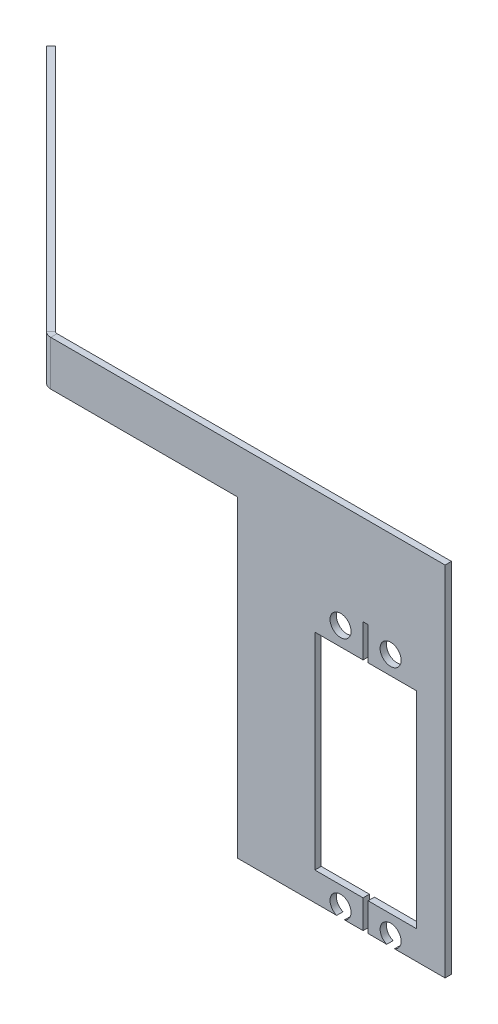
ISO-10303-21;
HEADER;
FILE_DESCRIPTION(('STEP AP214'),'2;1');
FILE_NAME('part.step','',(''),(''),'','','');
FILE_SCHEMA(('AUTOMOTIVE_DESIGN { 1 0 10303 214 1 1 1 1 }'));
ENDSEC;
DATA;
#1=APPLICATION_CONTEXT('core data for automotive mechanical design processes');
#2=APPLICATION_PROTOCOL_DEFINITION('international standard','automotive_design',2000,#1);
#3=PRODUCT_CONTEXT('',#1,'mechanical');
#4=PRODUCT('Part','Part','',(#3));
#5=PRODUCT_RELATED_PRODUCT_CATEGORY('part','',(#4));
#6=PRODUCT_DEFINITION_FORMATION('','',#4);
#7=PRODUCT_DEFINITION_CONTEXT('part definition',#1,'design');
#8=PRODUCT_DEFINITION('design','',#6,#7);
#9=PRODUCT_DEFINITION_SHAPE('','',#8);
#10=(LENGTH_UNIT() NAMED_UNIT(*) SI_UNIT(.MILLI.,.METRE.));
#11=(NAMED_UNIT(*) PLANE_ANGLE_UNIT() SI_UNIT($,.RADIAN.));
#12=(NAMED_UNIT(*) SI_UNIT($,.STERADIAN.) SOLID_ANGLE_UNIT());
#13=UNCERTAINTY_MEASURE_WITH_UNIT(LENGTH_MEASURE(1.E-05),#10,'distance_accuracy_value','');
#14=(GEOMETRIC_REPRESENTATION_CONTEXT(3) GLOBAL_UNCERTAINTY_ASSIGNED_CONTEXT((#13)) GLOBAL_UNIT_ASSIGNED_CONTEXT((#10,
#11,#12)) REPRESENTATION_CONTEXT('',''));
#15=CARTESIAN_POINT('',(0.,0.,0.));
#16=DIRECTION('',(0.,0.,1.));
#17=DIRECTION('',(1.,0.,0.));
#18=AXIS2_PLACEMENT_3D('',#15,#16,#17);
#19=CARTESIAN_POINT('',(-56.8418463273573,9.52499999999998,1.27000000000001));
#20=DIRECTION('',(0.,-1.,0.));
#21=DIRECTION('',(1.,0.,0.));
#22=AXIS2_PLACEMENT_3D('',#19,#20,#21);
#23=PLANE('',#22);
#24=DIRECTION('',(0.,0.,1.));
#25=VECTOR('',#24,1.);
#26=CARTESIAN_POINT('',(2.12440027263546,9.52500000000005,-49.6101558881365));
#27=LINE('',#26,#25);
#28=CARTESIAN_POINT('',(2.12440027263527,9.52499999999998,0.));
#29=VERTEX_POINT('',#28);
#30=CARTESIAN_POINT('',(2.12440027263528,9.52499999999998,1.26999999999991));
#31=VERTEX_POINT('',#30);
#32=EDGE_CURVE('E402',#29,#31,#27,.T.);
#33=ORIENTED_EDGE('',*,*,#32,.F.);
#34=DIRECTION('',(1.,0.,0.));
#35=VECTOR('',#34,1.);
#36=CARTESIAN_POINT('',(-56.8418463273573,9.52499999999998,0.));
#37=LINE('',#36,#35);
#38=CARTESIAN_POINT('',(5.84999999999999,9.52499999999998,-1.11022302462516E-13));
#39=VERTEX_POINT('',#38);
#40=EDGE_CURVE('E354',#29,#39,#37,.T.);
#41=ORIENTED_EDGE('',*,*,#40,.T.);
#42=DIRECTION('',(0.,0.,-1.));
#43=VECTOR('',#42,1.);
#44=CARTESIAN_POINT('',(5.84999999999999,9.52499999999998,1.27000000000001));
#45=LINE('',#44,#43);
#46=CARTESIAN_POINT('',(5.84999999999999,9.52499999999998,1.26999999999991));
#47=VERTEX_POINT('',#46);
#48=EDGE_CURVE('E393',#47,#39,#45,.T.);
#49=ORIENTED_EDGE('',*,*,#48,.F.);
#50=DIRECTION('',(1.,0.,0.));
#51=VECTOR('',#50,1.);
#52=CARTESIAN_POINT('',(-56.8418463273573,9.52499999999998,1.27000000000001));
#53=LINE('',#52,#51);
#54=EDGE_CURVE('E359',#31,#47,#53,.T.);
#55=ORIENTED_EDGE('',*,*,#54,.F.);
#56=EDGE_LOOP('',(#33,#41,#49,#55));
#57=FACE_BOUND('',#56,.T.);
#58=ADVANCED_FACE('F43',(#57),#23,.T.);
#59=DIRECTION('',(0.,0.,1.));
#60=VECTOR('',#59,1.);
#61=CARTESIAN_POINT('',(12.1244003386353,9.52500000000005,-49.6101558881365));
#62=LINE('',#61,#60);
#63=CARTESIAN_POINT('',(12.1244003386351,9.52499999999998,0.));
#64=VERTEX_POINT('',#63);
#65=CARTESIAN_POINT('',(12.1244003386351,9.52499999999998,1.26999999999991));
#66=VERTEX_POINT('',#65);
#67=EDGE_CURVE('E398',#64,#66,#62,.T.);
#68=ORIENTED_EDGE('',*,*,#67,.F.);
#69=CARTESIAN_POINT('',(22.225,9.52499999999998,-1.11076679072422E-13));
#70=VERTEX_POINT('',#69);
#71=EDGE_CURVE('E355',#64,#70,#37,.T.);
#72=ORIENTED_EDGE('',*,*,#71,.T.);
#73=DIRECTION('',(0.,0.,1.));
#74=VECTOR('',#73,1.);
#75=CARTESIAN_POINT('',(22.225,9.52499999999998,1.26999999999989));
#76=LINE('',#75,#74);
#77=CARTESIAN_POINT('',(22.225,9.52499999999998,1.26999999999989));
#78=VERTEX_POINT('',#77);
#79=EDGE_CURVE('E353',#78,#70,#76,.F.);
#80=ORIENTED_EDGE('',*,*,#79,.F.);
#81=EDGE_CURVE('E349',#66,#78,#53,.T.);
#82=ORIENTED_EDGE('',*,*,#81,.F.);
#83=EDGE_LOOP('',(#68,#72,#80,#82));
#84=FACE_BOUND('',#83,.T.);
#85=ADVANCED_FACE('F446',(#84),#23,.T.);
#86=DIRECTION('',(0.,0.,1.));
#87=VECTOR('',#86,1.);
#88=CARTESIAN_POINT('',(10.5755997273647,9.52500000000005,-49.6101558881365));
#89=LINE('',#88,#87);
#90=CARTESIAN_POINT('',(10.5755997273649,9.52499999999998,1.26999999999991));
#91=VERTEX_POINT('',#90);
#92=CARTESIAN_POINT('',(10.5755997273647,9.52500000000005,-1.11022302462516E-13));
#93=VERTEX_POINT('',#92);
#94=EDGE_CURVE('E396',#91,#93,#89,.F.);
#95=ORIENTED_EDGE('',*,*,#94,.F.);
#96=CARTESIAN_POINT('',(6.85,9.52499999999998,1.26999999999991));
#97=VERTEX_POINT('',#96);
#98=EDGE_CURVE('E485',#97,#91,#53,.T.);
#99=ORIENTED_EDGE('',*,*,#98,.F.);
#100=DIRECTION('',(0.,0.,1.));
#101=VECTOR('',#100,1.);
#102=CARTESIAN_POINT('',(6.85,9.52499999999998,1.27000000000001));
#103=LINE('',#102,#101);
#104=CARTESIAN_POINT('',(6.85,9.52499999999998,-1.11022302462516E-13));
#105=VERTEX_POINT('',#104);
#106=EDGE_CURVE('E235',#105,#97,#103,.T.);
#107=ORIENTED_EDGE('',*,*,#106,.F.);
#108=EDGE_CURVE('E487',#105,#93,#37,.T.);
#109=ORIENTED_EDGE('',*,*,#108,.T.);
#110=EDGE_LOOP('',(#95,#99,#107,#109));
#111=FACE_BOUND('',#110,.T.);
#112=ADVANCED_FACE('F454',(#111),#23,.T.);
#113=CARTESIAN_POINT('',(-19.2523962133271,72.008000002,-49.6101558881365));
#114=DIRECTION('',(0.,1.,0.));
#115=DIRECTION('',(-1.,0.,0.));
#116=AXIS2_PLACEMENT_3D('',#113,#114,#115);
#117=PLANE('',#116);
#118=DIRECTION('',(-0.707106781186551,0.,-0.707106781186544));
#119=VECTOR('',#118,1.);
#120=CARTESIAN_POINT('',(-106.452002215495,72.008000002,-49.6101558881365));
#121=LINE('',#120,#119);
#122=CARTESIAN_POINT('',(-57.0575914723354,72.008000002,-0.215745144977898));
#123=VERTEX_POINT('',#122);
#124=CARTESIAN_POINT('',(-106.452002215495,72.008000002,-49.6101558881365));
#125=VERTEX_POINT('',#124);
#126=EDGE_CURVE('E314',#123,#125,#121,.T.);
#127=ORIENTED_EDGE('',*,*,#126,.F.);
#128=DIRECTION('',(-0.707106781186513,0.,0.707106781186582));
#129=VECTOR('',#128,1.);
#130=CARTESIAN_POINT('',(-57.0575914723354,72.008000002,-0.215745144977898));
#131=LINE('',#130,#129);
#132=CARTESIAN_POINT('',(-57.9556170844423,72.008000002,0.682280467129044));
#133=VERTEX_POINT('',#132);
#134=EDGE_CURVE('E391',#123,#133,#131,.T.);
#135=ORIENTED_EDGE('',*,*,#134,.T.);
#136=DIRECTION('',(-0.707106781186551,0.,-0.707106781186544));
#137=VECTOR('',#136,1.);
#138=CARTESIAN_POINT('',(-107.350027827602,72.008000002,-48.7121302760296));
#139=LINE('',#138,#137);
#140=CARTESIAN_POINT('',(-107.350027827601,72.008000002,-48.7121302760295));
#141=VERTEX_POINT('',#140);
#142=EDGE_CURVE('E320',#133,#141,#139,.T.);
#143=ORIENTED_EDGE('',*,*,#142,.T.);
#144=DIRECTION('',(-0.707106781186542,0.,0.707106781186553));
#145=VECTOR('',#144,1.);
#146=CARTESIAN_POINT('',(-107.350027827601,72.008000002,-48.7121302760297));
#147=LINE('',#146,#145);
#148=EDGE_CURVE('E317',#125,#141,#147,.T.);
#149=ORIENTED_EDGE('',*,*,#148,.F.);
#150=EDGE_LOOP('',(#127,#135,#143,#149));
#151=FACE_BOUND('',#150,.T.);
#152=ADVANCED_FACE('F475',(#151),#117,.F.);
#153=DIRECTION('',(-1.,0.,0.));
#154=VECTOR('',#153,1.);
#155=CARTESIAN_POINT('',(-19.2523962133271,72.008000002,1.26999999999991));
#156=LINE('',#155,#154);
#157=CARTESIAN_POINT('',(-19.2523962133271,72.008000002,1.26999999999991));
#158=VERTEX_POINT('',#157);
#159=CARTESIAN_POINT('',(-56.5367366173134,72.008000002,1.26999999999991));
#160=VERTEX_POINT('',#159);
#161=EDGE_CURVE('E303',#158,#160,#156,.T.);
#162=ORIENTED_EDGE('',*,*,#161,.T.);
#163=DIRECTION('',(0.,0.,-1.));
#164=VECTOR('',#163,1.);
#165=CARTESIAN_POINT('',(-56.5367366173134,72.008000002,1.26999999999991));
#166=LINE('',#165,#164);
#167=CARTESIAN_POINT('',(-56.5367366173134,72.008000002,1.04021562545773E-13));
#168=VERTEX_POINT('',#167);
#169=EDGE_CURVE('E389',#160,#168,#166,.T.);
#170=ORIENTED_EDGE('',*,*,#169,.T.);
#171=DIRECTION('',(-1.,0.,0.));
#172=VECTOR('',#171,1.);
#173=CARTESIAN_POINT('',(-56.8418463273574,72.008000002,1.04503537382218E-13));
#174=LINE('',#173,#172);
#175=CARTESIAN_POINT('',(-19.2523962133271,72.008000002,0.));
#176=VERTEX_POINT('',#175);
#177=EDGE_CURVE('E386',#176,#168,#174,.T.);
#178=ORIENTED_EDGE('',*,*,#177,.F.);
#179=DIRECTION('',(0.,0.,1.));
#180=VECTOR('',#179,1.);
#181=CARTESIAN_POINT('',(-19.2523962133271,72.008000002,-49.6101558881365));
#182=LINE('',#181,#180);
#183=EDGE_CURVE('E306',#176,#158,#182,.T.);
#184=ORIENTED_EDGE('',*,*,#183,.T.);
#185=EDGE_LOOP('',(#162,#170,#178,#184));
#186=FACE_BOUND('',#185,.T.);
#187=ADVANCED_FACE('F481',(#186),#117,.F.);
#188=CARTESIAN_POINT('',(-56.5367366173134,80.9624999999999,1.1701702034567E-13));
#189=DIRECTION('',(0.,1.,0.));
#190=DIRECTION('',(0.,0.,1.));
#191=AXIS2_PLACEMENT_3D('',#188,#189,#190);
#192=PLANE('',#191);
#193=DIRECTION('',(0.,0.,1.));
#194=VECTOR('',#193,1.);
#195=CARTESIAN_POINT('',(-56.5367366173134,80.9624999999999,1.1701702034567E-13));
#196=LINE('',#195,#194);
#197=CARTESIAN_POINT('',(-56.5367366173134,80.9624999999999,1.1701702034567E-13));
#198=VERTEX_POINT('',#197);
#199=CARTESIAN_POINT('',(-56.5367366173134,80.9624999999999,1.27000000000012));
#200=VERTEX_POINT('',#199);
#201=EDGE_CURVE('E381',#198,#200,#196,.T.);
#202=ORIENTED_EDGE('',*,*,#201,.F.);
#203=CARTESIAN_POINT('',(-56.5367366173134,80.9624999999999,-0.736599999999881));
#204=DIRECTION('',(0.,1.,0.));
#205=DIRECTION('',(0.,0.,1.));
#206=AXIS2_PLACEMENT_3D('',#203,#204,#205);
#207=CIRCLE('',#206,0.7366);
#208=CARTESIAN_POINT('',(-57.0575914723354,80.9624999999999,-0.215745144977866));
#209=VERTEX_POINT('',#208);
#210=EDGE_CURVE('E334',#209,#198,#207,.T.);
#211=ORIENTED_EDGE('',*,*,#210,.F.);
#212=DIRECTION('',(0.707106781186546,0.,-0.707106781186549));
#213=VECTOR('',#212,1.);
#214=CARTESIAN_POINT('',(-57.9556170844423,80.9624999999999,0.682280467129048));
#215=LINE('',#214,#213);
#216=CARTESIAN_POINT('',(-57.9556170844423,80.9624999999999,0.682280467129048));
#217=VERTEX_POINT('',#216);
#218=EDGE_CURVE('E365',#217,#209,#215,.T.);
#219=ORIENTED_EDGE('',*,*,#218,.F.);
#220=CARTESIAN_POINT('',(-56.5367366173134,80.9624999999999,-0.736599999999881));
#221=DIRECTION('',(0.,1.,0.));
#222=DIRECTION('',(1.,0.,0.));
#223=AXIS2_PLACEMENT_3D('',#220,#221,#222);
#224=CIRCLE('',#223,2.0066);
#225=EDGE_CURVE('E346',#217,#200,#224,.T.);
#226=ORIENTED_EDGE('',*,*,#225,.T.);
#227=EDGE_LOOP('',(#202,#211,#219,#226));
#228=FACE_BOUND('',#227,.T.);
#229=ADVANCED_FACE('F45',(#228),#192,.T.);
#230=CARTESIAN_POINT('',(-57.9556170844423,80.9624999999999,0.682280467129048));
#231=DIRECTION('',(0.,1.,0.));
#232=DIRECTION('',(0.,0.,1.));
#233=AXIS2_PLACEMENT_3D('',#230,#231,#232);
#234=PLANE('',#233);
#235=DIRECTION('',(1.,0.,0.));
#236=VECTOR('',#235,1.);
#237=CARTESIAN_POINT('',(-56.8418463273574,80.9624999999999,1.17498995182115E-13));
#238=LINE('',#237,#236);
#239=CARTESIAN_POINT('',(22.225,80.9625,0.));
#240=VERTEX_POINT('',#239);
#241=EDGE_CURVE('E331',#198,#240,#238,.T.);
#242=ORIENTED_EDGE('',*,*,#241,.F.);
#243=ORIENTED_EDGE('',*,*,#201,.T.);
#244=DIRECTION('',(1.,0.,0.));
#245=VECTOR('',#244,1.);
#246=CARTESIAN_POINT('',(-56.8418463273574,80.9624999999999,1.27000000000012));
#247=LINE('',#246,#245);
#248=CARTESIAN_POINT('',(22.225,80.9625,1.26999999999999));
#249=VERTEX_POINT('',#248);
#250=EDGE_CURVE('E325',#200,#249,#247,.T.);
#251=ORIENTED_EDGE('',*,*,#250,.T.);
#252=DIRECTION('',(0.,0.,1.));
#253=VECTOR('',#252,1.);
#254=CARTESIAN_POINT('',(22.225,80.9625,0.));
#255=LINE('',#254,#253);
#256=EDGE_CURVE('E328',#240,#249,#255,.T.);
#257=ORIENTED_EDGE('',*,*,#256,.F.);
#258=EDGE_LOOP('',(#242,#243,#251,#257));
#259=FACE_BOUND('',#258,.T.);
#260=ADVANCED_FACE('F499',(#259),#234,.T.);
#261=CARTESIAN_POINT('',(-56.8418463273573,-132.856602213131,1.26999999999981));
#262=DIRECTION('',(0.,0.,1.));
#263=DIRECTION('',(1.,0.,0.));
#264=AXIS2_PLACEMENT_3D('',#261,#262,#263);
#265=PLANE('',#264);
#266=CARTESIAN_POINT('',(1.349999967,60.077000115,1.26999999999991));
#267=DIRECTION('',(0.,0.,1.));
#268=DIRECTION('',(1.,0.,0.));
#269=AXIS2_PLACEMENT_3D('',#266,#267,#268);
#270=CIRCLE('',#269,2.099999991);
#271=CARTESIAN_POINT('',(3.449999958,60.077000115,1.26999999999991));
#272=VERTEX_POINT('',#271);
#273=EDGE_CURVE('E579',#272,#272,#270,.T.);
#274=ORIENTED_EDGE('',*,*,#273,.F.);
#275=EDGE_LOOP('',(#274));
#276=FACE_BOUND('',#275,.T.);
#277=CARTESIAN_POINT('',(11.350000033,60.077000115,1.26999999999991));
#278=DIRECTION('',(0.,0.,1.));
#279=DIRECTION('',(1.,0.,0.));
#280=AXIS2_PLACEMENT_3D('',#277,#278,#279);
#281=CIRCLE('',#280,2.09999999099994);
#282=CARTESIAN_POINT('',(13.4500000239999,60.077000115,1.26999999999991));
#283=VERTEX_POINT('',#282);
#284=EDGE_CURVE('E575',#283,#283,#281,.T.);
#285=ORIENTED_EDGE('',*,*,#284,.F.);
#286=EDGE_LOOP('',(#285));
#287=FACE_BOUND('',#286,.T.);
#288=CARTESIAN_POINT('',(1.349999967,11.477000033,1.26999999999991));
#289=DIRECTION('',(0.,0.,1.));
#290=DIRECTION('',(1.,0.,0.));
#291=AXIS2_PLACEMENT_3D('',#288,#289,#290);
#292=CIRCLE('',#291,2.09999999100001);
#293=CARTESIAN_POINT('',(0.575599661364716,9.52499999999998,1.26999999999992));
#294=VERTEX_POINT('',#293);
#295=EDGE_CURVE('E572',#31,#294,#292,.T.);
#296=ORIENTED_EDGE('',*,*,#295,.F.);
#297=ORIENTED_EDGE('',*,*,#54,.T.);
#298=DIRECTION('',(0.,-1.,0.));
#299=VECTOR('',#298,1.);
#300=CARTESIAN_POINT('',(5.85,15.20000008,1.26999999999991));
#301=LINE('',#300,#299);
#302=CARTESIAN_POINT('',(5.85,15.20000008,1.26999999999991));
#303=VERTEX_POINT('',#302);
#304=EDGE_CURVE('E68',#303,#47,#301,.T.);
#305=ORIENTED_EDGE('',*,*,#304,.F.);
#306=DIRECTION('',(1.,0.,0.));
#307=VECTOR('',#306,1.);
#308=CARTESIAN_POINT('',(-3.77699993900001,15.20000008,1.26999999999991));
#309=LINE('',#308,#307);
#310=CARTESIAN_POINT('',(-3.77699993900001,15.20000008,1.26999999999991));
#311=VERTEX_POINT('',#310);
#312=EDGE_CURVE('E267',#311,#303,#309,.T.);
#313=ORIENTED_EDGE('',*,*,#312,.F.);
#314=DIRECTION('',(0.,-1.,0.));
#315=VECTOR('',#314,1.);
#316=CARTESIAN_POINT('',(-3.77699993900001,56.354000068,1.26999999999991));
#317=LINE('',#316,#315);
#318=CARTESIAN_POINT('',(-3.77699993900001,56.354000068,1.26999999999991));
#319=VERTEX_POINT('',#318);
#320=EDGE_CURVE('E264',#319,#311,#317,.T.);
#321=ORIENTED_EDGE('',*,*,#320,.F.);
#322=DIRECTION('',(-1.,0.,0.));
#323=VECTOR('',#322,1.);
#324=CARTESIAN_POINT('',(5.84999999999999,56.354000068,1.26999999999991));
#325=LINE('',#324,#323);
#326=CARTESIAN_POINT('',(5.84999999999999,56.354000068,1.26999999999991));
#327=VERTEX_POINT('',#326);
#328=EDGE_CURVE('E261',#327,#319,#325,.T.);
#329=ORIENTED_EDGE('',*,*,#328,.F.);
#330=DIRECTION('',(0.,-1.,0.));
#331=VECTOR('',#330,1.);
#332=CARTESIAN_POINT('',(5.84999999999999,62.958000068,1.26999999999991));
#333=LINE('',#332,#331);
#334=CARTESIAN_POINT('',(5.84999999999999,62.958000068,1.26999999999991));
#335=VERTEX_POINT('',#334);
#336=EDGE_CURVE('E258',#335,#327,#333,.T.);
#337=ORIENTED_EDGE('',*,*,#336,.F.);
#338=DIRECTION('',(-1.,0.,0.));
#339=VECTOR('',#338,1.);
#340=CARTESIAN_POINT('',(6.85,62.958000068,1.26999999999991));
#341=LINE('',#340,#339);
#342=CARTESIAN_POINT('',(6.85,62.958000068,1.26999999999991));
#343=VERTEX_POINT('',#342);
#344=EDGE_CURVE('E255',#343,#335,#341,.T.);
#345=ORIENTED_EDGE('',*,*,#344,.F.);
#346=DIRECTION('',(0.,1.,0.));
#347=VECTOR('',#346,1.);
#348=CARTESIAN_POINT('',(6.85,56.354000068,1.26999999999991));
#349=LINE('',#348,#347);
#350=CARTESIAN_POINT('',(6.85,56.354000068,1.26999999999991));
#351=VERTEX_POINT('',#350);
#352=EDGE_CURVE('E252',#351,#343,#349,.T.);
#353=ORIENTED_EDGE('',*,*,#352,.F.);
#354=DIRECTION('',(-1.,0.,0.));
#355=VECTOR('',#354,1.);
#356=CARTESIAN_POINT('',(16.476999939,56.354000068,1.26999999999991));
#357=LINE('',#356,#355);
#358=CARTESIAN_POINT('',(16.476999939,56.354000068,1.26999999999991));
#359=VERTEX_POINT('',#358);
#360=EDGE_CURVE('E246',#359,#351,#357,.T.);
#361=ORIENTED_EDGE('',*,*,#360,.F.);
#362=DIRECTION('',(0.,1.,0.));
#363=VECTOR('',#362,1.);
#364=CARTESIAN_POINT('',(16.476999939,15.20000008,1.26999999999991));
#365=LINE('',#364,#363);
#366=CARTESIAN_POINT('',(16.476999939,15.20000008,1.26999999999991));
#367=VERTEX_POINT('',#366);
#368=EDGE_CURVE('E244',#367,#359,#365,.T.);
#369=ORIENTED_EDGE('',*,*,#368,.F.);
#370=DIRECTION('',(1.,0.,0.));
#371=VECTOR('',#370,1.);
#372=CARTESIAN_POINT('',(6.85,15.20000008,1.26999999999991));
#373=LINE('',#372,#371);
#374=CARTESIAN_POINT('',(6.85,15.20000008,1.26999999999991));
#375=VERTEX_POINT('',#374);
#376=EDGE_CURVE('E223',#375,#367,#373,.T.);
#377=ORIENTED_EDGE('',*,*,#376,.F.);
#378=DIRECTION('',(0.,1.,0.));
#379=VECTOR('',#378,1.);
#380=CARTESIAN_POINT('',(6.85,8.59600007999999,1.26999999999991));
#381=LINE('',#380,#379);
#382=EDGE_CURVE('E232',#97,#375,#381,.T.);
#383=ORIENTED_EDGE('',*,*,#382,.F.);
#384=ORIENTED_EDGE('',*,*,#98,.T.);
#385=CARTESIAN_POINT('',(11.350000033,11.477000033,1.26999999999991));
#386=DIRECTION('',(0.,0.,1.));
#387=DIRECTION('',(1.,0.,0.));
#388=AXIS2_PLACEMENT_3D('',#385,#386,#387);
#389=CIRCLE('',#388,2.09999999099995);
#390=EDGE_CURVE('E60',#66,#91,#389,.T.);
#391=ORIENTED_EDGE('',*,*,#390,.F.);
#392=ORIENTED_EDGE('',*,*,#81,.T.);
#393=DIRECTION('',(0.,1.,0.));
#394=VECTOR('',#393,1.);
#395=CARTESIAN_POINT('',(22.2250000000001,-132.856602213131,1.26999999999968));
#396=LINE('',#395,#394);
#397=EDGE_CURVE('E362',#78,#249,#396,.T.);
#398=ORIENTED_EDGE('',*,*,#397,.T.);
#399=ORIENTED_EDGE('',*,*,#250,.F.);
#400=DIRECTION('',(0.,1.,0.));
#401=VECTOR('',#400,1.);
#402=CARTESIAN_POINT('',(-56.5367366173133,-132.856602213131,1.26999999999981));
#403=LINE('',#402,#401);
#404=EDGE_CURVE('E363',#160,#200,#403,.T.);
#405=ORIENTED_EDGE('',*,*,#404,.F.);
#406=ORIENTED_EDGE('',*,*,#161,.F.);
#407=DIRECTION('',(0.,1.,0.));
#408=VECTOR('',#407,1.);
#409=CARTESIAN_POINT('',(-19.2523962133271,72.008000002,1.26999999999991));
#410=LINE('',#409,#408);
#411=CARTESIAN_POINT('',(-19.2523962133271,9.52499999999999,1.26999999999991));
#412=VERTEX_POINT('',#411);
#413=EDGE_CURVE('E300',#412,#158,#410,.T.);
#414=ORIENTED_EDGE('',*,*,#413,.F.);
#415=EDGE_CURVE('E356',#412,#294,#53,.T.);
#416=ORIENTED_EDGE('',*,*,#415,.T.);
#417=EDGE_LOOP('',(#296,#297,#305,#313,#321,#329,#337,#345,#353,#361,#369,#377,#383,#384,#391,
#392,#398,#399,#405,#406,#414,#416));
#418=FACE_BOUND('',#417,.T.);
#419=ADVANCED_FACE('F241',(#276,#287,#418),#265,.T.);
#420=CARTESIAN_POINT('',(-56.5367366173133,-132.856602213131,-0.736600000000191));
#421=DIRECTION('',(0.,1.,0.));
#422=DIRECTION('',(0.,0.,1.));
#423=AXIS2_PLACEMENT_3D('',#420,#421,#422);
#424=CYLINDRICAL_SURFACE('',#423,2.0066);
#425=CARTESIAN_POINT('',(-56.5367366173134,72.008000002,-0.736599999999894));
#426=DIRECTION('',(0.,1.,0.));
#427=DIRECTION('',(-1.,0.,0.));
#428=AXIS2_PLACEMENT_3D('',#425,#426,#427);
#429=CIRCLE('',#428,2.0066);
#430=EDGE_CURVE('E322',#160,#133,#429,.F.);
#431=ORIENTED_EDGE('',*,*,#430,.F.);
#432=ORIENTED_EDGE('',*,*,#404,.T.);
#433=ORIENTED_EDGE('',*,*,#225,.F.);
#434=DIRECTION('',(0.,1.,0.));
#435=VECTOR('',#434,1.);
#436=CARTESIAN_POINT('',(-57.9556170844422,-132.856602213131,0.682280467128737));
#437=LINE('',#436,#435);
#438=EDGE_CURVE('E366',#133,#217,#437,.T.);
#439=ORIENTED_EDGE('',*,*,#438,.F.);
#440=EDGE_LOOP('',(#431,#432,#433,#439));
#441=FACE_BOUND('',#440,.T.);
#442=ADVANCED_FACE('F515',(#441),#424,.T.);
#443=CARTESIAN_POINT('',(-107.350027827601,-132.856602213131,-48.7121302760298));
#444=DIRECTION('',(-0.707106781186544,0.,0.707106781186552));
#445=DIRECTION('',(0.707106781186551,0.,0.707106781186544));
#446=AXIS2_PLACEMENT_3D('',#443,#444,#445);
#447=PLANE('',#446);
#448=ORIENTED_EDGE('',*,*,#142,.F.);
#449=ORIENTED_EDGE('',*,*,#438,.T.);
#450=DIRECTION('',(0.707106781186551,0.,0.707106781186544));
#451=VECTOR('',#450,1.);
#452=CARTESIAN_POINT('',(-107.350027827601,80.9625,-48.7121302760295));
#453=LINE('',#452,#451);
#454=CARTESIAN_POINT('',(-107.350027827601,80.9625,-48.7121302760295));
#455=VERTEX_POINT('',#454);
#456=EDGE_CURVE('E343',#455,#217,#453,.T.);
#457=ORIENTED_EDGE('',*,*,#456,.F.);
#458=DIRECTION('',(0.,1.,0.));
#459=VECTOR('',#458,1.);
#460=CARTESIAN_POINT('',(-107.350027827601,-132.856602213131,-48.7121302760298));
#461=LINE('',#460,#459);
#462=EDGE_CURVE('E368',#141,#455,#461,.T.);
#463=ORIENTED_EDGE('',*,*,#462,.F.);
#464=EDGE_LOOP('',(#448,#449,#457,#463));
#465=FACE_BOUND('',#464,.T.);
#466=ADVANCED_FACE('F522',(#465),#447,.T.);
#467=CARTESIAN_POINT('',(-107.350027827601,-132.856602213131,-48.7121302760298));
#468=DIRECTION('',(0.707106781186553,0.,0.707106781186542));
#469=DIRECTION('',(0.707106781186542,0.,-0.707106781186553));
#470=AXIS2_PLACEMENT_3D('',#467,#468,#469);
#471=PLANE('',#470);
#472=DIRECTION('',(0.,1.,0.));
#473=VECTOR('',#472,1.);
#474=CARTESIAN_POINT('',(-106.452002215494,-132.856602213131,-49.6101558881367));
#475=LINE('',#474,#473);
#476=CARTESIAN_POINT('',(-106.452002215494,80.9625,-49.6101558881364));
#477=VERTEX_POINT('',#476);
#478=EDGE_CURVE('E370',#125,#477,#475,.T.);
#479=ORIENTED_EDGE('',*,*,#478,.F.);
#480=ORIENTED_EDGE('',*,*,#148,.T.);
#481=ORIENTED_EDGE('',*,*,#462,.T.);
#482=DIRECTION('',(0.707106781186542,0.,-0.707106781186553));
#483=VECTOR('',#482,1.);
#484=CARTESIAN_POINT('',(-107.350027827601,80.9625,-48.7121302760295));
#485=LINE('',#484,#483);
#486=EDGE_CURVE('E340',#455,#477,#485,.T.);
#487=ORIENTED_EDGE('',*,*,#486,.T.);
#488=EDGE_LOOP('',(#479,#480,#481,#487));
#489=FACE_BOUND('',#488,.T.);
#490=ADVANCED_FACE('F526',(#489),#471,.F.);
#491=CARTESIAN_POINT('',(-106.452002215494,-132.856602213131,-49.6101558881367));
#492=DIRECTION('',(-0.707106781186544,0.,0.707106781186551));
#493=DIRECTION('',(0.707106781186551,0.,0.707106781186544));
#494=AXIS2_PLACEMENT_3D('',#491,#492,#493);
#495=PLANE('',#494);
#496=DIRECTION('',(0.,1.,0.));
#497=VECTOR('',#496,1.);
#498=CARTESIAN_POINT('',(-57.0575914723353,-132.856602213131,-0.215745144978177));
#499=LINE('',#498,#497);
#500=EDGE_CURVE('E372',#123,#209,#499,.T.);
#501=ORIENTED_EDGE('',*,*,#500,.F.);
#502=ORIENTED_EDGE('',*,*,#126,.T.);
#503=ORIENTED_EDGE('',*,*,#478,.T.);
#504=DIRECTION('',(0.707106781186551,0.,0.707106781186544));
#505=VECTOR('',#504,1.);
#506=CARTESIAN_POINT('',(-106.452002215494,80.9625,-49.6101558881364));
#507=LINE('',#506,#505);
#508=EDGE_CURVE('E337',#477,#209,#507,.T.);
#509=ORIENTED_EDGE('',*,*,#508,.T.);
#510=EDGE_LOOP('',(#501,#502,#503,#509));
#511=FACE_BOUND('',#510,.T.);
#512=ADVANCED_FACE('F531',(#511),#495,.F.);
#513=CARTESIAN_POINT('',(-56.5367366173133,-132.856602213131,-0.736600000000191));
#514=DIRECTION('',(0.,1.,0.));
#515=DIRECTION('',(0.,0.,1.));
#516=AXIS2_PLACEMENT_3D('',#513,#514,#515);
#517=CYLINDRICAL_SURFACE('',#516,0.7366);
#518=DIRECTION('',(0.,1.,0.));
#519=VECTOR('',#518,1.);
#520=CARTESIAN_POINT('',(-56.5367366173133,-132.856602213131,-1.93293674862689E-13));
#521=LINE('',#520,#519);
#522=EDGE_CURVE('E374',#168,#198,#521,.T.);
#523=ORIENTED_EDGE('',*,*,#522,.F.);
#524=CARTESIAN_POINT('',(-56.5367366173134,72.008000002,-0.736599999999894));
#525=DIRECTION('',(0.,1.,0.));
#526=DIRECTION('',(-1.,0.,0.));
#527=AXIS2_PLACEMENT_3D('',#524,#525,#526);
#528=CIRCLE('',#527,0.7366);
#529=EDGE_CURVE('E311',#168,#123,#528,.F.);
#530=ORIENTED_EDGE('',*,*,#529,.T.);
#531=ORIENTED_EDGE('',*,*,#500,.T.);
#532=ORIENTED_EDGE('',*,*,#210,.T.);
#533=EDGE_LOOP('',(#523,#530,#531,#532));
#534=FACE_BOUND('',#533,.T.);
#535=ADVANCED_FACE('F532',(#534),#517,.F.);
#536=CARTESIAN_POINT('',(-56.8418463273573,-132.856602213131,-1.92811700026244E-13));
#537=DIRECTION('',(0.,0.,1.));
#538=DIRECTION('',(1.,0.,0.));
#539=AXIS2_PLACEMENT_3D('',#536,#537,#538);
#540=PLANE('',#539);
#541=CARTESIAN_POINT('',(1.349999967,60.077000115,0.));
#542=DIRECTION('',(0.,0.,1.));
#543=DIRECTION('',(1.,0.,0.));
#544=AXIS2_PLACEMENT_3D('',#541,#542,#543);
#545=CIRCLE('',#544,2.099999991);
#546=CARTESIAN_POINT('',(3.449999958,60.077000115,0.));
#547=VERTEX_POINT('',#546);
#548=EDGE_CURVE('E47',#547,#547,#545,.T.);
#549=ORIENTED_EDGE('',*,*,#548,.T.);
#550=EDGE_LOOP('',(#549));
#551=FACE_BOUND('',#550,.T.);
#552=CARTESIAN_POINT('',(11.350000033,60.077000115,0.));
#553=DIRECTION('',(0.,0.,1.));
#554=DIRECTION('',(1.,0.,0.));
#555=AXIS2_PLACEMENT_3D('',#552,#553,#554);
#556=CIRCLE('',#555,2.09999999099994);
#557=CARTESIAN_POINT('',(13.4500000239999,60.077000115,0.));
#558=VERTEX_POINT('',#557);
#559=EDGE_CURVE('E299',#558,#558,#556,.T.);
#560=ORIENTED_EDGE('',*,*,#559,.T.);
#561=EDGE_LOOP('',(#560));
#562=FACE_BOUND('',#561,.T.);
#563=ORIENTED_EDGE('',*,*,#40,.F.);
#564=CARTESIAN_POINT('',(1.349999967,11.477000033,0.));
#565=DIRECTION('',(0.,0.,1.));
#566=DIRECTION('',(1.,0.,0.));
#567=AXIS2_PLACEMENT_3D('',#564,#565,#566);
#568=CIRCLE('',#567,2.09999999100001);
#569=CARTESIAN_POINT('',(0.57559966136453,9.52500000000005,-1.11022302462516E-13));
#570=VERTEX_POINT('',#569);
#571=EDGE_CURVE('E296',#29,#570,#568,.T.);
#572=ORIENTED_EDGE('',*,*,#571,.T.);
#573=CARTESIAN_POINT('',(-19.2523962133271,9.52499999999998,0.));
#574=VERTEX_POINT('',#573);
#575=EDGE_CURVE('E350',#574,#570,#37,.T.);
#576=ORIENTED_EDGE('',*,*,#575,.F.);
#577=DIRECTION('',(0.,1.,0.));
#578=VECTOR('',#577,1.);
#579=CARTESIAN_POINT('',(-19.2523962133271,-132.856602213131,-2.52190895359423E-13));
#580=LINE('',#579,#578);
#581=EDGE_CURVE('E308',#574,#176,#580,.T.);
#582=ORIENTED_EDGE('',*,*,#581,.T.);
#583=ORIENTED_EDGE('',*,*,#177,.T.);
#584=ORIENTED_EDGE('',*,*,#522,.T.);
#585=ORIENTED_EDGE('',*,*,#241,.T.);
#586=DIRECTION('',(0.,1.,0.));
#587=VECTOR('',#586,1.);
#588=CARTESIAN_POINT('',(22.2250000000001,-132.856602213131,-3.17711790296471E-13));
#589=LINE('',#588,#587);
#590=EDGE_CURVE('E376',#70,#240,#589,.T.);
#591=ORIENTED_EDGE('',*,*,#590,.F.);
#592=ORIENTED_EDGE('',*,*,#71,.F.);
#593=CARTESIAN_POINT('',(11.350000033,11.477000033,0.));
#594=DIRECTION('',(0.,0.,1.));
#595=DIRECTION('',(1.,0.,0.));
#596=AXIS2_PLACEMENT_3D('',#593,#594,#595);
#597=CIRCLE('',#596,2.09999999099995);
#598=EDGE_CURVE('E293',#64,#93,#597,.T.);
#599=ORIENTED_EDGE('',*,*,#598,.T.);
#600=ORIENTED_EDGE('',*,*,#108,.F.);
#601=DIRECTION('',(0.,1.,0.));
#602=VECTOR('',#601,1.);
#603=CARTESIAN_POINT('',(6.85,-132.856602213131,-2.93424254153269E-13));
#604=LINE('',#603,#602);
#605=CARTESIAN_POINT('',(6.85,15.20000008,0.));
#606=VERTEX_POINT('',#605);
#607=EDGE_CURVE('E291',#105,#606,#604,.T.);
#608=ORIENTED_EDGE('',*,*,#607,.T.);
#609=DIRECTION('',(1.,0.,0.));
#610=VECTOR('',#609,1.);
#611=CARTESIAN_POINT('',(-56.8418463273573,15.20000008,0.));
#612=LINE('',#611,#610);
#613=CARTESIAN_POINT('',(16.476999939,15.20000008,0.));
#614=VERTEX_POINT('',#613);
#615=EDGE_CURVE('E226',#606,#614,#612,.T.);
#616=ORIENTED_EDGE('',*,*,#615,.T.);
#617=DIRECTION('',(0.,1.,0.));
#618=VECTOR('',#617,1.);
#619=CARTESIAN_POINT('',(16.4769999389999,-132.856602213131,-3.08631805956135E-13));
#620=LINE('',#619,#618);
#621=CARTESIAN_POINT('',(16.476999939,56.354000068,0.));
#622=VERTEX_POINT('',#621);
#623=EDGE_CURVE('E405',#614,#622,#620,.T.);
#624=ORIENTED_EDGE('',*,*,#623,.T.);
#625=DIRECTION('',(-1.,0.,0.));
#626=VECTOR('',#625,1.);
#627=CARTESIAN_POINT('',(-56.8418463273573,56.354000068,0.));
#628=LINE('',#627,#626);
#629=CARTESIAN_POINT('',(6.85,56.354000068,0.));
#630=VERTEX_POINT('',#629);
#631=EDGE_CURVE('E408',#622,#630,#628,.T.);
#632=ORIENTED_EDGE('',*,*,#631,.T.);
#633=DIRECTION('',(0.,1.,0.));
#634=VECTOR('',#633,1.);
#635=CARTESIAN_POINT('',(6.85,-132.856602213131,-2.93424254153269E-13));
#636=LINE('',#635,#634);
#637=CARTESIAN_POINT('',(6.85,62.958000068,0.));
#638=VERTEX_POINT('',#637);
#639=EDGE_CURVE('E411',#630,#638,#636,.T.);
#640=ORIENTED_EDGE('',*,*,#639,.T.);
#641=DIRECTION('',(-1.,0.,0.));
#642=VECTOR('',#641,1.);
#643=CARTESIAN_POINT('',(-56.8418463273573,62.958000068,0.));
#644=LINE('',#643,#642);
#645=CARTESIAN_POINT('',(5.84999999999999,62.958000068,0.));
#646=VERTEX_POINT('',#645);
#647=EDGE_CURVE('E414',#638,#646,#644,.T.);
#648=ORIENTED_EDGE('',*,*,#647,.T.);
#649=DIRECTION('',(0.,-1.,0.));
#650=VECTOR('',#649,1.);
#651=CARTESIAN_POINT('',(5.84999999999999,-132.856602213131,-2.91844577005743E-13));
#652=LINE('',#651,#650);
#653=CARTESIAN_POINT('',(5.84999999999999,56.354000068,0.));
#654=VERTEX_POINT('',#653);
#655=EDGE_CURVE('E417',#646,#654,#652,.T.);
#656=ORIENTED_EDGE('',*,*,#655,.T.);
#657=DIRECTION('',(-1.,0.,0.));
#658=VECTOR('',#657,1.);
#659=CARTESIAN_POINT('',(-56.8418463273573,56.354000068,0.));
#660=LINE('',#659,#658);
#661=CARTESIAN_POINT('',(-3.77699993900001,56.354000068,0.));
#662=VERTEX_POINT('',#661);
#663=EDGE_CURVE('E420',#654,#662,#660,.T.);
#664=ORIENTED_EDGE('',*,*,#663,.T.);
#665=DIRECTION('',(0.,-1.,0.));
#666=VECTOR('',#665,1.);
#667=CARTESIAN_POINT('',(-3.77699993900001,-132.856602213131,-2.76637025202877E-13));
#668=LINE('',#667,#666);
#669=CARTESIAN_POINT('',(-3.77699993900001,15.20000008,0.));
#670=VERTEX_POINT('',#669);
#671=EDGE_CURVE('E52',#662,#670,#668,.T.);
#672=ORIENTED_EDGE('',*,*,#671,.T.);
#673=DIRECTION('',(1.,0.,0.));
#674=VECTOR('',#673,1.);
#675=CARTESIAN_POINT('',(-56.8418463273573,15.20000008,0.));
#676=LINE('',#675,#674);
#677=CARTESIAN_POINT('',(5.85,15.20000008,0.));
#678=VERTEX_POINT('',#677);
#679=EDGE_CURVE('E11',#670,#678,#676,.T.);
#680=ORIENTED_EDGE('',*,*,#679,.T.);
#681=DIRECTION('',(0.,-1.,0.));
#682=VECTOR('',#681,1.);
#683=CARTESIAN_POINT('',(5.84999999999999,-132.856602213131,-2.91844577005743E-13));
#684=LINE('',#683,#682);
#685=EDGE_CURVE('E273',#678,#39,#684,.T.);
#686=ORIENTED_EDGE('',*,*,#685,.T.);
#687=EDGE_LOOP('',(#563,#572,#576,#582,#583,#584,#585,#591,#592,#599,#600,#608,#616,#624,#632,
#640,#648,#656,#664,#672,#680,#686));
#688=FACE_BOUND('',#687,.T.);
#689=ADVANCED_FACE('F430',(#551,#562,#688),#540,.F.);
#690=CARTESIAN_POINT('',(22.2250000000001,-132.856602213131,-3.17711790296471E-13));
#691=DIRECTION('',(-1.,0.,0.));
#692=DIRECTION('',(0.,0.,1.));
#693=AXIS2_PLACEMENT_3D('',#690,#691,#692);
#694=PLANE('',#693);
#695=ORIENTED_EDGE('',*,*,#79,.T.);
#696=ORIENTED_EDGE('',*,*,#590,.T.);
#697=ORIENTED_EDGE('',*,*,#256,.T.);
#698=ORIENTED_EDGE('',*,*,#397,.F.);
#699=EDGE_LOOP('',(#695,#696,#697,#698));
#700=FACE_BOUND('',#699,.T.);
#701=ADVANCED_FACE('F461',(#700),#694,.F.);
#702=DIRECTION('',(0.,0.,1.));
#703=VECTOR('',#702,1.);
#704=CARTESIAN_POINT('',(0.57559966136453,9.52500000000005,-49.6101558881365));
#705=LINE('',#704,#703);
#706=EDGE_CURVE('E400',#294,#570,#705,.F.);
#707=ORIENTED_EDGE('',*,*,#706,.F.);
#708=ORIENTED_EDGE('',*,*,#415,.F.);
#709=DIRECTION('',(0.,0.,1.));
#710=VECTOR('',#709,1.);
#711=CARTESIAN_POINT('',(-19.2523962133271,9.52499999999998,1.27000000000001));
#712=LINE('',#711,#710);
#713=EDGE_CURVE('E384',#574,#412,#712,.T.);
#714=ORIENTED_EDGE('',*,*,#713,.F.);
#715=ORIENTED_EDGE('',*,*,#575,.T.);
#716=EDGE_LOOP('',(#707,#708,#714,#715));
#717=FACE_BOUND('',#716,.T.);
#718=ADVANCED_FACE('F449',(#717),#23,.T.);
#719=CARTESIAN_POINT('',(-56.5367366173134,80.9624999999999,-0.736599999999881));
#720=DIRECTION('',(0.,1.,0.));
#721=DIRECTION('',(0.,0.,1.));
#722=AXIS2_PLACEMENT_3D('',#719,#720,#721);
#723=PLANE('',#722);
#724=ORIENTED_EDGE('',*,*,#456,.T.);
#725=ORIENTED_EDGE('',*,*,#218,.T.);
#726=ORIENTED_EDGE('',*,*,#508,.F.);
#727=ORIENTED_EDGE('',*,*,#486,.F.);
#728=EDGE_LOOP('',(#724,#725,#726,#727));
#729=FACE_BOUND('',#728,.T.);
#730=ADVANCED_FACE('F460',(#729),#723,.T.);
#731=ORIENTED_EDGE('',*,*,#134,.F.);
#732=ORIENTED_EDGE('',*,*,#529,.F.);
#733=ORIENTED_EDGE('',*,*,#169,.F.);
#734=ORIENTED_EDGE('',*,*,#430,.T.);
#735=EDGE_LOOP('',(#731,#732,#733,#734));
#736=FACE_BOUND('',#735,.T.);
#737=ADVANCED_FACE('F468',(#736),#117,.F.);
#738=CARTESIAN_POINT('',(-19.2523962133271,72.008000002,-49.6101558881365));
#739=DIRECTION('',(1.,0.,0.));
#740=DIRECTION('',(0.,1.,0.));
#741=AXIS2_PLACEMENT_3D('',#738,#739,#740);
#742=PLANE('',#741);
#743=ORIENTED_EDGE('',*,*,#713,.T.);
#744=ORIENTED_EDGE('',*,*,#413,.T.);
#745=ORIENTED_EDGE('',*,*,#183,.F.);
#746=ORIENTED_EDGE('',*,*,#581,.F.);
#747=EDGE_LOOP('',(#743,#744,#745,#746));
#748=FACE_BOUND('',#747,.T.);
#749=ADVANCED_FACE('F557',(#748),#742,.F.);
#750=CARTESIAN_POINT('',(-3.77699993900001,15.20000008,-49.6101558881365));
#751=DIRECTION('',(0.,-1.,0.));
#752=DIRECTION('',(0.,0.,-1.));
#753=AXIS2_PLACEMENT_3D('',#750,#751,#752);
#754=PLANE('',#753);
#755=DIRECTION('',(0.,0.,1.));
#756=VECTOR('',#755,1.);
#757=CARTESIAN_POINT('',(-3.77699993900001,15.20000008,-49.6101558881365));
#758=LINE('',#757,#756);
#759=EDGE_CURVE('E274',#670,#311,#758,.T.);
#760=ORIENTED_EDGE('',*,*,#759,.T.);
#761=ORIENTED_EDGE('',*,*,#312,.T.);
#762=DIRECTION('',(0.,0.,1.));
#763=VECTOR('',#762,1.);
#764=CARTESIAN_POINT('',(5.85,15.20000008,-49.6101558881365));
#765=LINE('',#764,#763);
#766=EDGE_CURVE('E271',#678,#303,#765,.T.);
#767=ORIENTED_EDGE('',*,*,#766,.F.);
#768=ORIENTED_EDGE('',*,*,#679,.F.);
#769=EDGE_LOOP('',(#760,#761,#767,#768));
#770=FACE_BOUND('',#769,.T.);
#771=ADVANCED_FACE('F560',(#770),#754,.F.);
#772=CARTESIAN_POINT('',(-3.77699993900001,56.354000068,-49.6101558881365));
#773=DIRECTION('',(-1.,0.,0.));
#774=DIRECTION('',(0.,-1.,0.));
#775=AXIS2_PLACEMENT_3D('',#772,#773,#774);
#776=PLANE('',#775);
#777=DIRECTION('',(0.,0.,1.));
#778=VECTOR('',#777,1.);
#779=CARTESIAN_POINT('',(-3.77699993900001,56.354000068,-49.6101558881365));
#780=LINE('',#779,#778);
#781=EDGE_CURVE('E276',#662,#319,#780,.T.);
#782=ORIENTED_EDGE('',*,*,#781,.T.);
#783=ORIENTED_EDGE('',*,*,#320,.T.);
#784=ORIENTED_EDGE('',*,*,#759,.F.);
#785=ORIENTED_EDGE('',*,*,#671,.F.);
#786=EDGE_LOOP('',(#782,#783,#784,#785));
#787=FACE_BOUND('',#786,.T.);
#788=ADVANCED_FACE('F564',(#787),#776,.F.);
#789=CARTESIAN_POINT('',(5.84999999999999,56.354000068,-49.6101558881365));
#790=DIRECTION('',(0.,1.,0.));
#791=DIRECTION('',(0.,0.,1.));
#792=AXIS2_PLACEMENT_3D('',#789,#790,#791);
#793=PLANE('',#792);
#794=DIRECTION('',(0.,0.,1.));
#795=VECTOR('',#794,1.);
#796=CARTESIAN_POINT('',(5.84999999999999,56.354000068,-49.6101558881365));
#797=LINE('',#796,#795);
#798=EDGE_CURVE('E278',#654,#327,#797,.T.);
#799=ORIENTED_EDGE('',*,*,#798,.T.);
#800=ORIENTED_EDGE('',*,*,#328,.T.);
#801=ORIENTED_EDGE('',*,*,#781,.F.);
#802=ORIENTED_EDGE('',*,*,#663,.F.);
#803=EDGE_LOOP('',(#799,#800,#801,#802));
#804=FACE_BOUND('',#803,.T.);
#805=ADVANCED_FACE('F593',(#804),#793,.F.);
#806=CARTESIAN_POINT('',(5.84999999999999,62.958000068,-49.6101558881365));
#807=DIRECTION('',(-1.,0.,0.));
#808=DIRECTION('',(0.,0.,1.));
#809=AXIS2_PLACEMENT_3D('',#806,#807,#808);
#810=PLANE('',#809);
#811=DIRECTION('',(0.,0.,1.));
#812=VECTOR('',#811,1.);
#813=CARTESIAN_POINT('',(5.84999999999999,62.958000068,-49.6101558881365));
#814=LINE('',#813,#812);
#815=EDGE_CURVE('E280',#646,#335,#814,.T.);
#816=ORIENTED_EDGE('',*,*,#815,.T.);
#817=ORIENTED_EDGE('',*,*,#336,.T.);
#818=ORIENTED_EDGE('',*,*,#798,.F.);
#819=ORIENTED_EDGE('',*,*,#655,.F.);
#820=EDGE_LOOP('',(#816,#817,#818,#819));
#821=FACE_BOUND('',#820,.T.);
#822=ADVANCED_FACE('F599',(#821),#810,.F.);
#823=CARTESIAN_POINT('',(6.85,62.958000068,-49.6101558881365));
#824=DIRECTION('',(0.,1.,0.));
#825=DIRECTION('',(0.,0.,1.));
#826=AXIS2_PLACEMENT_3D('',#823,#824,#825);
#827=PLANE('',#826);
#828=DIRECTION('',(0.,0.,1.));
#829=VECTOR('',#828,1.);
#830=CARTESIAN_POINT('',(6.85,62.958000068,-49.6101558881365));
#831=LINE('',#830,#829);
#832=EDGE_CURVE('E282',#638,#343,#831,.T.);
#833=ORIENTED_EDGE('',*,*,#832,.T.);
#834=ORIENTED_EDGE('',*,*,#344,.T.);
#835=ORIENTED_EDGE('',*,*,#815,.F.);
#836=ORIENTED_EDGE('',*,*,#647,.F.);
#837=EDGE_LOOP('',(#833,#834,#835,#836));
#838=FACE_BOUND('',#837,.T.);
#839=ADVANCED_FACE('F602',(#838),#827,.F.);
#840=CARTESIAN_POINT('',(6.85,56.354000068,-49.6101558881365));
#841=DIRECTION('',(1.,0.,0.));
#842=DIRECTION('',(0.,0.,-1.));
#843=AXIS2_PLACEMENT_3D('',#840,#841,#842);
#844=PLANE('',#843);
#845=DIRECTION('',(0.,0.,1.));
#846=VECTOR('',#845,1.);
#847=CARTESIAN_POINT('',(6.85,56.354000068,-49.6101558881365));
#848=LINE('',#847,#846);
#849=EDGE_CURVE('E284',#630,#351,#848,.T.);
#850=ORIENTED_EDGE('',*,*,#849,.T.);
#851=ORIENTED_EDGE('',*,*,#352,.T.);
#852=ORIENTED_EDGE('',*,*,#832,.F.);
#853=ORIENTED_EDGE('',*,*,#639,.F.);
#854=EDGE_LOOP('',(#850,#851,#852,#853));
#855=FACE_BOUND('',#854,.T.);
#856=ADVANCED_FACE('F605',(#855),#844,.F.);
#857=CARTESIAN_POINT('',(16.476999939,56.354000068,-49.6101558881365));
#858=DIRECTION('',(0.,1.,0.));
#859=DIRECTION('',(0.,0.,1.));
#860=AXIS2_PLACEMENT_3D('',#857,#858,#859);
#861=PLANE('',#860);
#862=DIRECTION('',(0.,0.,1.));
#863=VECTOR('',#862,1.);
#864=CARTESIAN_POINT('',(16.476999939,56.354000068,-49.6101558881365));
#865=LINE('',#864,#863);
#866=EDGE_CURVE('E286',#622,#359,#865,.T.);
#867=ORIENTED_EDGE('',*,*,#866,.T.);
#868=ORIENTED_EDGE('',*,*,#360,.T.);
#869=ORIENTED_EDGE('',*,*,#849,.F.);
#870=ORIENTED_EDGE('',*,*,#631,.F.);
#871=EDGE_LOOP('',(#867,#868,#869,#870));
#872=FACE_BOUND('',#871,.T.);
#873=ADVANCED_FACE('F608',(#872),#861,.F.);
#874=CARTESIAN_POINT('',(16.476999939,15.20000008,-49.6101558881365));
#875=DIRECTION('',(1.,0.,0.));
#876=DIRECTION('',(0.,1.,0.));
#877=AXIS2_PLACEMENT_3D('',#874,#875,#876);
#878=PLANE('',#877);
#879=DIRECTION('',(0.,0.,1.));
#880=VECTOR('',#879,1.);
#881=CARTESIAN_POINT('',(16.476999939,15.20000008,-49.6101558881365));
#882=LINE('',#881,#880);
#883=EDGE_CURVE('E229',#614,#367,#882,.T.);
#884=ORIENTED_EDGE('',*,*,#883,.T.);
#885=ORIENTED_EDGE('',*,*,#368,.T.);
#886=ORIENTED_EDGE('',*,*,#866,.F.);
#887=ORIENTED_EDGE('',*,*,#623,.F.);
#888=EDGE_LOOP('',(#884,#885,#886,#887));
#889=FACE_BOUND('',#888,.T.);
#890=ADVANCED_FACE('F611',(#889),#878,.F.);
#891=CARTESIAN_POINT('',(6.85,15.20000008,-49.6101558881365));
#892=DIRECTION('',(0.,-1.,0.));
#893=DIRECTION('',(1.,0.,0.));
#894=AXIS2_PLACEMENT_3D('',#891,#892,#893);
#895=PLANE('',#894);
#896=DIRECTION('',(0.,0.,1.));
#897=VECTOR('',#896,1.);
#898=CARTESIAN_POINT('',(6.85,15.20000008,-49.6101558881365));
#899=LINE('',#898,#897);
#900=EDGE_CURVE('E218',#606,#375,#899,.T.);
#901=ORIENTED_EDGE('',*,*,#900,.T.);
#902=ORIENTED_EDGE('',*,*,#376,.T.);
#903=ORIENTED_EDGE('',*,*,#883,.F.);
#904=ORIENTED_EDGE('',*,*,#615,.F.);
#905=EDGE_LOOP('',(#901,#902,#903,#904));
#906=FACE_BOUND('',#905,.T.);
#907=ADVANCED_FACE('F220',(#906),#895,.F.);
#908=CARTESIAN_POINT('',(6.85,8.59600007999999,-49.6101558881365));
#909=DIRECTION('',(1.,0.,0.));
#910=DIRECTION('',(0.,0.,-1.));
#911=AXIS2_PLACEMENT_3D('',#908,#909,#910);
#912=PLANE('',#911);
#913=ORIENTED_EDGE('',*,*,#106,.T.);
#914=ORIENTED_EDGE('',*,*,#382,.T.);
#915=ORIENTED_EDGE('',*,*,#900,.F.);
#916=ORIENTED_EDGE('',*,*,#607,.F.);
#917=EDGE_LOOP('',(#913,#914,#915,#916));
#918=FACE_BOUND('',#917,.T.);
#919=ADVANCED_FACE('F233',(#918),#912,.F.);
#920=CARTESIAN_POINT('',(5.85,15.20000008,-49.6101558881365));
#921=DIRECTION('',(-1.,0.,0.));
#922=DIRECTION('',(0.,0.,1.));
#923=AXIS2_PLACEMENT_3D('',#920,#921,#922);
#924=PLANE('',#923);
#925=ORIENTED_EDGE('',*,*,#766,.T.);
#926=ORIENTED_EDGE('',*,*,#304,.T.);
#927=ORIENTED_EDGE('',*,*,#48,.T.);
#928=ORIENTED_EDGE('',*,*,#685,.F.);
#929=EDGE_LOOP('',(#925,#926,#927,#928));
#930=FACE_BOUND('',#929,.T.);
#931=ADVANCED_FACE('F614',(#930),#924,.F.);
#932=CARTESIAN_POINT('',(11.350000033,11.477000033,-49.6101558881365));
#933=DIRECTION('',(0.,0.,1.));
#934=DIRECTION('',(1.,0.,0.));
#935=AXIS2_PLACEMENT_3D('',#932,#933,#934);
#936=CYLINDRICAL_SURFACE('',#935,2.09999999099995);
#937=ORIENTED_EDGE('',*,*,#67,.T.);
#938=ORIENTED_EDGE('',*,*,#390,.T.);
#939=ORIENTED_EDGE('',*,*,#94,.T.);
#940=ORIENTED_EDGE('',*,*,#598,.F.);
#941=EDGE_LOOP('',(#937,#938,#939,#940));
#942=FACE_BOUND('',#941,.T.);
#943=ADVANCED_FACE('F612',(#942),#936,.F.);
#944=CARTESIAN_POINT('',(1.349999967,11.477000033,-49.6101558881365));
#945=DIRECTION('',(0.,0.,1.));
#946=DIRECTION('',(1.,0.,0.));
#947=AXIS2_PLACEMENT_3D('',#944,#945,#946);
#948=CYLINDRICAL_SURFACE('',#947,2.09999999100001);
#949=ORIENTED_EDGE('',*,*,#32,.T.);
#950=ORIENTED_EDGE('',*,*,#295,.T.);
#951=ORIENTED_EDGE('',*,*,#706,.T.);
#952=ORIENTED_EDGE('',*,*,#571,.F.);
#953=EDGE_LOOP('',(#949,#950,#951,#952));
#954=FACE_BOUND('',#953,.T.);
#955=ADVANCED_FACE('F440',(#954),#948,.F.);
#956=CARTESIAN_POINT('',(11.350000033,60.077000115,-49.6101558881365));
#957=DIRECTION('',(0.,0.,1.));
#958=DIRECTION('',(1.,0.,0.));
#959=AXIS2_PLACEMENT_3D('',#956,#957,#958);
#960=CYLINDRICAL_SURFACE('',#959,2.09999999099994);
#961=ORIENTED_EDGE('',*,*,#284,.T.);
#962=EDGE_LOOP('',(#961));
#963=FACE_BOUND('',#962,.T.);
#964=ORIENTED_EDGE('',*,*,#559,.F.);
#965=EDGE_LOOP('',(#964));
#966=FACE_BOUND('',#965,.T.);
#967=ADVANCED_FACE('F434',(#963,#966),#960,.F.);
#968=CARTESIAN_POINT('',(1.349999967,60.077000115,-49.6101558881365));
#969=DIRECTION('',(0.,0.,1.));
#970=DIRECTION('',(1.,0.,0.));
#971=AXIS2_PLACEMENT_3D('',#968,#969,#970);
#972=CYLINDRICAL_SURFACE('',#971,2.099999991);
#973=ORIENTED_EDGE('',*,*,#273,.T.);
#974=EDGE_LOOP('',(#973));
#975=FACE_BOUND('',#974,.T.);
#976=ORIENTED_EDGE('',*,*,#548,.F.);
#977=EDGE_LOOP('',(#976));
#978=FACE_BOUND('',#977,.T.);
#979=ADVANCED_FACE('F432',(#975,#978),#972,.F.);
#980=CLOSED_SHELL('',(#58,#85,#112,#152,#187,#229,#260,#419,#442,#466,#490,#512,#535,#689,#701,
#718,#730,#737,#749,#771,#788,#805,#822,#839,#856,#873,#890,#907,#919,#931,#943,#955,#967,#979));
#981=MANIFOLD_SOLID_BREP('B2',#980);
#982=ADVANCED_BREP_SHAPE_REPRESENTATION('',(#18,#981),#14);
#983=SHAPE_DEFINITION_REPRESENTATION(#9,#982);
ENDSEC;
END-ISO-10303-21;
